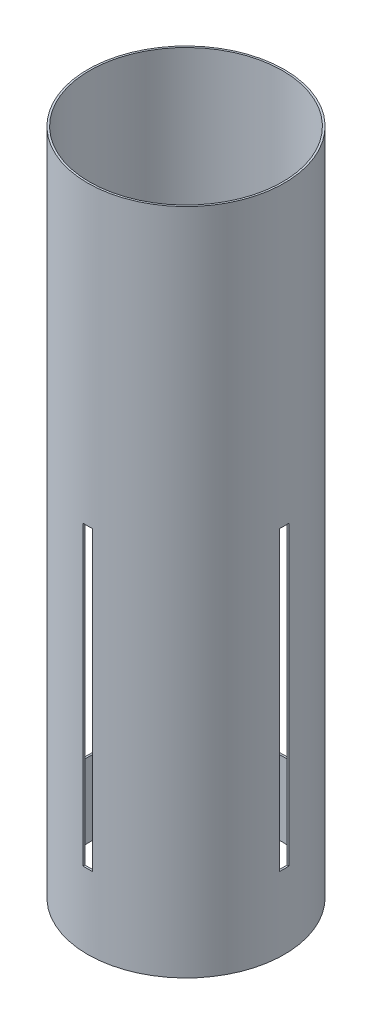
ISO-10303-21;
HEADER;
FILE_DESCRIPTION(('STEP AP214'),'2;1');
FILE_NAME('part.step','',(''),(''),'','','');
FILE_SCHEMA(('AUTOMOTIVE_DESIGN { 1 0 10303 214 1 1 1 1 }'));
ENDSEC;
DATA;
#1=APPLICATION_CONTEXT('core data for automotive mechanical design processes');
#2=APPLICATION_PROTOCOL_DEFINITION('international standard','automotive_design',2000,#1);
#3=PRODUCT_CONTEXT('',#1,'mechanical');
#4=PRODUCT('Part','Part','',(#3));
#5=PRODUCT_RELATED_PRODUCT_CATEGORY('part','',(#4));
#6=PRODUCT_DEFINITION_FORMATION('','',#4);
#7=PRODUCT_DEFINITION_CONTEXT('part definition',#1,'design');
#8=PRODUCT_DEFINITION('design','',#6,#7);
#9=PRODUCT_DEFINITION_SHAPE('','',#8);
#10=(LENGTH_UNIT() NAMED_UNIT(*) SI_UNIT(.MILLI.,.METRE.));
#11=(NAMED_UNIT(*) PLANE_ANGLE_UNIT() SI_UNIT($,.RADIAN.));
#12=(NAMED_UNIT(*) SI_UNIT($,.STERADIAN.) SOLID_ANGLE_UNIT());
#13=UNCERTAINTY_MEASURE_WITH_UNIT(LENGTH_MEASURE(1.E-05),#10,'distance_accuracy_value','');
#14=(GEOMETRIC_REPRESENTATION_CONTEXT(3) GLOBAL_UNCERTAINTY_ASSIGNED_CONTEXT((#13)) GLOBAL_UNIT_ASSIGNED_CONTEXT((#10,
#11,#12)) REPRESENTATION_CONTEXT('',''));
#15=CARTESIAN_POINT('',(0.,0.,0.));
#16=DIRECTION('',(0.,0.,1.));
#17=DIRECTION('',(1.,0.,0.));
#18=AXIS2_PLACEMENT_3D('',#15,#16,#17);
#19=CARTESIAN_POINT('',(0.,457.2,0.));
#20=DIRECTION('',(0.,-1.,0.));
#21=DIRECTION('',(0.,0.,-1.));
#22=AXIS2_PLACEMENT_3D('',#19,#20,#21);
#23=CYLINDRICAL_SURFACE('',#22,67.31);
#24=DIRECTION('',(0.,-1.,0.));
#25=VECTOR('',#24,1.);
#26=CARTESIAN_POINT('',(3.175,457.2,-67.2350762251371));
#27=LINE('',#26,#25);
#28=CARTESIAN_POINT('',(3.175,50.8,-67.2350762251371));
#29=VERTEX_POINT('',#28);
#30=CARTESIAN_POINT('',(3.175,254.,-67.2350762251371));
#31=VERTEX_POINT('',#30);
#32=EDGE_CURVE('E204',#29,#31,#27,.F.);
#33=ORIENTED_EDGE('',*,*,#32,.T.);
#34=CARTESIAN_POINT('',(0.,254.,0.));
#35=DIRECTION('',(0.,1.,0.));
#36=DIRECTION('',(0.,0.,1.));
#37=AXIS2_PLACEMENT_3D('',#34,#35,#36);
#38=CIRCLE('',#37,67.31);
#39=CARTESIAN_POINT('',(-3.175,254.,-67.2350762251371));
#40=VERTEX_POINT('',#39);
#41=EDGE_CURVE('E213',#31,#40,#38,.T.);
#42=ORIENTED_EDGE('',*,*,#41,.T.);
#43=DIRECTION('',(0.,-1.,0.));
#44=VECTOR('',#43,1.);
#45=CARTESIAN_POINT('',(-3.175,457.2,-67.2350762251371));
#46=LINE('',#45,#44);
#47=CARTESIAN_POINT('',(-3.175,50.8,-67.2350762251371));
#48=VERTEX_POINT('',#47);
#49=EDGE_CURVE('E214',#48,#40,#46,.F.);
#50=ORIENTED_EDGE('',*,*,#49,.F.);
#51=CARTESIAN_POINT('',(0.,50.8,0.));
#52=DIRECTION('',(0.,1.,0.));
#53=DIRECTION('',(0.,0.,1.));
#54=AXIS2_PLACEMENT_3D('',#51,#52,#53);
#55=CIRCLE('',#54,67.31);
#56=EDGE_CURVE('E202',#29,#48,#55,.T.);
#57=ORIENTED_EDGE('',*,*,#56,.F.);
#58=EDGE_LOOP('',(#33,#42,#50,#57));
#59=FACE_BOUND('',#58,.T.);
#60=CARTESIAN_POINT('',(0.,0.,0.));
#61=DIRECTION('',(0.,1.,0.));
#62=DIRECTION('',(0.,0.,1.));
#63=AXIS2_PLACEMENT_3D('',#60,#61,#62);
#64=CIRCLE('',#63,67.31);
#65=CARTESIAN_POINT('',(0.,0.,67.31));
#66=VERTEX_POINT('',#65);
#67=EDGE_CURVE('E224',#66,#66,#64,.T.);
#68=ORIENTED_EDGE('',*,*,#67,.T.);
#69=EDGE_LOOP('',(#68));
#70=FACE_BOUND('',#69,.T.);
#71=CARTESIAN_POINT('',(0.,457.2,0.));
#72=DIRECTION('',(0.,1.,0.));
#73=DIRECTION('',(0.,0.,1.));
#74=AXIS2_PLACEMENT_3D('',#71,#72,#73);
#75=CIRCLE('',#74,67.31);
#76=CARTESIAN_POINT('',(0.,457.2,67.31));
#77=VERTEX_POINT('',#76);
#78=EDGE_CURVE('E227',#77,#77,#75,.T.);
#79=ORIENTED_EDGE('',*,*,#78,.F.);
#80=EDGE_LOOP('',(#79));
#81=FACE_BOUND('',#80,.T.);
#82=CARTESIAN_POINT('',(-3.175,254.,67.2350762251371));
#83=VERTEX_POINT('',#82);
#84=CARTESIAN_POINT('',(3.175,254.,67.2350762251371));
#85=VERTEX_POINT('',#84);
#86=EDGE_CURVE('E211',#83,#85,#38,.T.);
#87=ORIENTED_EDGE('',*,*,#86,.T.);
#88=DIRECTION('',(0.,-1.,0.));
#89=VECTOR('',#88,1.);
#90=CARTESIAN_POINT('',(3.175,457.2,67.2350762251371));
#91=LINE('',#90,#89);
#92=CARTESIAN_POINT('',(3.175,50.8,67.2350762251371));
#93=VERTEX_POINT('',#92);
#94=EDGE_CURVE('E208',#85,#93,#91,.T.);
#95=ORIENTED_EDGE('',*,*,#94,.T.);
#96=CARTESIAN_POINT('',(-3.175,50.8,67.2350762251371));
#97=VERTEX_POINT('',#96);
#98=EDGE_CURVE('E205',#97,#93,#55,.T.);
#99=ORIENTED_EDGE('',*,*,#98,.F.);
#100=DIRECTION('',(0.,-1.,0.));
#101=VECTOR('',#100,1.);
#102=CARTESIAN_POINT('',(-3.175,457.2,67.2350762251371));
#103=LINE('',#102,#101);
#104=EDGE_CURVE('E217',#83,#97,#103,.T.);
#105=ORIENTED_EDGE('',*,*,#104,.F.);
#106=EDGE_LOOP('',(#87,#95,#99,#105));
#107=FACE_BOUND('',#106,.T.);
#108=DIRECTION('',(0.,-1.,0.));
#109=VECTOR('',#108,1.);
#110=CARTESIAN_POINT('',(67.2350762251371,457.2,3.17499999999976));
#111=LINE('',#110,#109);
#112=CARTESIAN_POINT('',(67.2350762251371,254.,3.17499999999977));
#113=VERTEX_POINT('',#112);
#114=CARTESIAN_POINT('',(67.2350762251371,50.8,3.17499999999977));
#115=VERTEX_POINT('',#114);
#116=EDGE_CURVE('E184',#113,#115,#111,.T.);
#117=ORIENTED_EDGE('',*,*,#116,.F.);
#118=CARTESIAN_POINT('',(0.,254.,0.));
#119=DIRECTION('',(0.,1.,0.));
#120=DIRECTION('',(0.,0.,1.));
#121=AXIS2_PLACEMENT_3D('',#118,#119,#120);
#122=CIRCLE('',#121,67.31);
#123=CARTESIAN_POINT('',(67.2350762251371,254.,-3.17500000000023));
#124=VERTEX_POINT('',#123);
#125=EDGE_CURVE('E158',#113,#124,#122,.T.);
#126=ORIENTED_EDGE('',*,*,#125,.T.);
#127=DIRECTION('',(0.,-1.,0.));
#128=VECTOR('',#127,1.);
#129=CARTESIAN_POINT('',(67.2350762251371,457.2,-3.17500000000023));
#130=LINE('',#129,#128);
#131=CARTESIAN_POINT('',(67.2350762251371,50.8,-3.17500000000023));
#132=VERTEX_POINT('',#131);
#133=EDGE_CURVE('E181',#124,#132,#130,.T.);
#134=ORIENTED_EDGE('',*,*,#133,.T.);
#135=CARTESIAN_POINT('',(0.,50.8,0.));
#136=DIRECTION('',(0.,1.,0.));
#137=DIRECTION('',(0.,0.,1.));
#138=AXIS2_PLACEMENT_3D('',#135,#136,#137);
#139=CIRCLE('',#138,67.31);
#140=EDGE_CURVE('E168',#115,#132,#139,.T.);
#141=ORIENTED_EDGE('',*,*,#140,.F.);
#142=EDGE_LOOP('',(#117,#126,#134,#141));
#143=FACE_BOUND('',#142,.T.);
#144=DIRECTION('',(0.,-1.,0.));
#145=VECTOR('',#144,1.);
#146=CARTESIAN_POINT('',(-67.2350762251371,457.2,-3.17499999999976));
#147=LINE('',#146,#145);
#148=CARTESIAN_POINT('',(-67.2350762251371,50.8,-3.17499999999977));
#149=VERTEX_POINT('',#148);
#150=CARTESIAN_POINT('',(-67.2350762251371,254.,-3.17499999999977));
#151=VERTEX_POINT('',#150);
#152=EDGE_CURVE('E148',#149,#151,#147,.F.);
#153=ORIENTED_EDGE('',*,*,#152,.T.);
#154=CARTESIAN_POINT('',(-67.2350762251371,254.,3.17500000000023));
#155=VERTEX_POINT('',#154);
#156=EDGE_CURVE('E178',#151,#155,#122,.T.);
#157=ORIENTED_EDGE('',*,*,#156,.T.);
#158=DIRECTION('',(0.,-1.,0.));
#159=VECTOR('',#158,1.);
#160=CARTESIAN_POINT('',(-67.2350762251371,457.2,3.17500000000023));
#161=LINE('',#160,#159);
#162=CARTESIAN_POINT('',(-67.2350762251371,50.8,3.17500000000023));
#163=VERTEX_POINT('',#162);
#164=EDGE_CURVE('E157',#163,#155,#161,.F.);
#165=ORIENTED_EDGE('',*,*,#164,.F.);
#166=EDGE_CURVE('E161',#149,#163,#139,.T.);
#167=ORIENTED_EDGE('',*,*,#166,.F.);
#168=EDGE_LOOP('',(#153,#157,#165,#167));
#169=FACE_BOUND('',#168,.T.);
#170=ADVANCED_FACE('F35',(#59,#70,#81,#107,#143,#169),#23,.T.);
#171=CARTESIAN_POINT('',(0.,457.2,0.));
#172=DIRECTION('',(0.,-1.,0.));
#173=DIRECTION('',(0.,0.,-1.));
#174=AXIS2_PLACEMENT_3D('',#171,#172,#173);
#175=CYLINDRICAL_SURFACE('',#174,66.04);
#176=CARTESIAN_POINT('',(0.,254.,0.));
#177=DIRECTION('',(0.,1.,0.));
#178=DIRECTION('',(0.,0.,1.));
#179=AXIS2_PLACEMENT_3D('',#176,#177,#178);
#180=CIRCLE('',#179,66.04);
#181=CARTESIAN_POINT('',(65.9636337310188,254.,3.17499999999977));
#182=VERTEX_POINT('',#181);
#183=CARTESIAN_POINT('',(65.9636337310188,254.,-3.17500000000023));
#184=VERTEX_POINT('',#183);
#185=EDGE_CURVE('E176',#182,#184,#180,.T.);
#186=ORIENTED_EDGE('',*,*,#185,.F.);
#187=DIRECTION('',(0.,-1.,0.));
#188=VECTOR('',#187,1.);
#189=CARTESIAN_POINT('',(65.9636337310188,457.2,3.17499999999977));
#190=LINE('',#189,#188);
#191=CARTESIAN_POINT('',(65.9636337310188,50.8,3.17499999999977));
#192=VERTEX_POINT('',#191);
#193=EDGE_CURVE('E11',#182,#192,#190,.T.);
#194=ORIENTED_EDGE('',*,*,#193,.T.);
#195=CARTESIAN_POINT('',(0.,50.8,0.));
#196=DIRECTION('',(0.,1.,0.));
#197=DIRECTION('',(0.,0.,1.));
#198=AXIS2_PLACEMENT_3D('',#195,#196,#197);
#199=CIRCLE('',#198,66.04);
#200=CARTESIAN_POINT('',(65.9636337310188,50.8,-3.17500000000023));
#201=VERTEX_POINT('',#200);
#202=EDGE_CURVE('E169',#192,#201,#199,.T.);
#203=ORIENTED_EDGE('',*,*,#202,.T.);
#204=DIRECTION('',(0.,-1.,0.));
#205=VECTOR('',#204,1.);
#206=CARTESIAN_POINT('',(65.9636337310188,457.2,-3.17500000000023));
#207=LINE('',#206,#205);
#208=EDGE_CURVE('E42',#184,#201,#207,.T.);
#209=ORIENTED_EDGE('',*,*,#208,.F.);
#210=EDGE_LOOP('',(#186,#194,#203,#209));
#211=FACE_BOUND('',#210,.T.);
#212=CARTESIAN_POINT('',(0.,457.2,0.));
#213=DIRECTION('',(0.,1.,0.));
#214=DIRECTION('',(0.,0.,1.));
#215=AXIS2_PLACEMENT_3D('',#212,#213,#214);
#216=CIRCLE('',#215,66.04);
#217=CARTESIAN_POINT('',(0.,457.2,66.04));
#218=VERTEX_POINT('',#217);
#219=EDGE_CURVE('E221',#218,#218,#216,.T.);
#220=ORIENTED_EDGE('',*,*,#219,.T.);
#221=EDGE_LOOP('',(#220));
#222=FACE_BOUND('',#221,.T.);
#223=CARTESIAN_POINT('',(0.,0.,0.));
#224=DIRECTION('',(0.,1.,0.));
#225=DIRECTION('',(0.,0.,1.));
#226=AXIS2_PLACEMENT_3D('',#223,#224,#225);
#227=CIRCLE('',#226,66.04);
#228=CARTESIAN_POINT('',(0.,0.,66.04));
#229=VERTEX_POINT('',#228);
#230=EDGE_CURVE('E220',#229,#229,#227,.T.);
#231=ORIENTED_EDGE('',*,*,#230,.F.);
#232=EDGE_LOOP('',(#231));
#233=FACE_BOUND('',#232,.T.);
#234=CARTESIAN_POINT('',(0.,254.,0.));
#235=DIRECTION('',(0.,1.,0.));
#236=DIRECTION('',(0.,0.,1.));
#237=AXIS2_PLACEMENT_3D('',#234,#235,#236);
#238=CIRCLE('',#237,66.04);
#239=CARTESIAN_POINT('',(-3.175,254.,65.9636337310188));
#240=VERTEX_POINT('',#239);
#241=CARTESIAN_POINT('',(3.175,254.,65.9636337310188));
#242=VERTEX_POINT('',#241);
#243=EDGE_CURVE('E239',#240,#242,#238,.T.);
#244=ORIENTED_EDGE('',*,*,#243,.F.);
#245=DIRECTION('',(0.,-1.,0.));
#246=VECTOR('',#245,1.);
#247=CARTESIAN_POINT('',(-3.175,457.2,65.9636337310188));
#248=LINE('',#247,#246);
#249=CARTESIAN_POINT('',(-3.175,50.8,65.9636337310188));
#250=VERTEX_POINT('',#249);
#251=EDGE_CURVE('E241',#240,#250,#248,.T.);
#252=ORIENTED_EDGE('',*,*,#251,.T.);
#253=CARTESIAN_POINT('',(0.,50.8,0.));
#254=DIRECTION('',(0.,1.,0.));
#255=DIRECTION('',(0.,0.,1.));
#256=AXIS2_PLACEMENT_3D('',#253,#254,#255);
#257=CIRCLE('',#256,66.04);
#258=CARTESIAN_POINT('',(3.175,50.8,65.9636337310188));
#259=VERTEX_POINT('',#258);
#260=EDGE_CURVE('E230',#250,#259,#257,.T.);
#261=ORIENTED_EDGE('',*,*,#260,.T.);
#262=DIRECTION('',(0.,-1.,0.));
#263=VECTOR('',#262,1.);
#264=CARTESIAN_POINT('',(3.175,457.2,65.9636337310188));
#265=LINE('',#264,#263);
#266=EDGE_CURVE('E235',#242,#259,#265,.T.);
#267=ORIENTED_EDGE('',*,*,#266,.F.);
#268=EDGE_LOOP('',(#244,#252,#261,#267));
#269=FACE_BOUND('',#268,.T.);
#270=CARTESIAN_POINT('',(3.175,50.8,-65.9636337310188));
#271=VERTEX_POINT('',#270);
#272=CARTESIAN_POINT('',(-3.175,50.8,-65.9636337310188));
#273=VERTEX_POINT('',#272);
#274=EDGE_CURVE('E236',#271,#273,#257,.T.);
#275=ORIENTED_EDGE('',*,*,#274,.T.);
#276=DIRECTION('',(0.,-1.,0.));
#277=VECTOR('',#276,1.);
#278=CARTESIAN_POINT('',(-3.175,457.2,-65.9636337310188));
#279=LINE('',#278,#277);
#280=CARTESIAN_POINT('',(-3.175,254.,-65.9636337310188));
#281=VERTEX_POINT('',#280);
#282=EDGE_CURVE('E247',#273,#281,#279,.F.);
#283=ORIENTED_EDGE('',*,*,#282,.T.);
#284=CARTESIAN_POINT('',(3.175,254.,-65.9636337310188));
#285=VERTEX_POINT('',#284);
#286=EDGE_CURVE('E242',#285,#281,#238,.T.);
#287=ORIENTED_EDGE('',*,*,#286,.F.);
#288=DIRECTION('',(0.,-1.,0.));
#289=VECTOR('',#288,1.);
#290=CARTESIAN_POINT('',(3.175,457.2,-65.9636337310188));
#291=LINE('',#290,#289);
#292=EDGE_CURVE('E245',#271,#285,#291,.F.);
#293=ORIENTED_EDGE('',*,*,#292,.F.);
#294=EDGE_LOOP('',(#275,#283,#287,#293));
#295=FACE_BOUND('',#294,.T.);
#296=CARTESIAN_POINT('',(-65.9636337310188,50.8,-3.17499999999977));
#297=VERTEX_POINT('',#296);
#298=CARTESIAN_POINT('',(-65.9636337310188,50.8,3.17500000000023));
#299=VERTEX_POINT('',#298);
#300=EDGE_CURVE('E163',#297,#299,#199,.T.);
#301=ORIENTED_EDGE('',*,*,#300,.T.);
#302=DIRECTION('',(0.,-1.,0.));
#303=VECTOR('',#302,1.);
#304=CARTESIAN_POINT('',(-65.9636337310188,457.2,3.17500000000023));
#305=LINE('',#304,#303);
#306=CARTESIAN_POINT('',(-65.9636337310188,254.,3.17500000000023));
#307=VERTEX_POINT('',#306);
#308=EDGE_CURVE('E252',#299,#307,#305,.F.);
#309=ORIENTED_EDGE('',*,*,#308,.T.);
#310=CARTESIAN_POINT('',(-65.9636337310188,254.,-3.17499999999977));
#311=VERTEX_POINT('',#310);
#312=EDGE_CURVE('E171',#311,#307,#180,.T.);
#313=ORIENTED_EDGE('',*,*,#312,.F.);
#314=DIRECTION('',(0.,-1.,0.));
#315=VECTOR('',#314,1.);
#316=CARTESIAN_POINT('',(-65.9636337310188,457.2,-3.17499999999977));
#317=LINE('',#316,#315);
#318=EDGE_CURVE('E250',#297,#311,#317,.F.);
#319=ORIENTED_EDGE('',*,*,#318,.F.);
#320=EDGE_LOOP('',(#301,#309,#313,#319));
#321=FACE_BOUND('',#320,.T.);
#322=ADVANCED_FACE('F262',(#211,#222,#233,#269,#295,#321),#175,.F.);
#323=CARTESIAN_POINT('',(0.,457.2,0.));
#324=DIRECTION('',(0.,1.,0.));
#325=DIRECTION('',(0.,0.,1.));
#326=AXIS2_PLACEMENT_3D('',#323,#324,#325);
#327=PLANE('',#326);
#328=ORIENTED_EDGE('',*,*,#78,.T.);
#329=EDGE_LOOP('',(#328));
#330=FACE_BOUND('',#329,.T.);
#331=ORIENTED_EDGE('',*,*,#219,.F.);
#332=EDGE_LOOP('',(#331));
#333=FACE_BOUND('',#332,.T.);
#334=ADVANCED_FACE('F302',(#330,#333),#327,.T.);
#335=CARTESIAN_POINT('',(0.,0.,0.));
#336=DIRECTION('',(0.,1.,0.));
#337=DIRECTION('',(0.,0.,1.));
#338=AXIS2_PLACEMENT_3D('',#335,#336,#337);
#339=PLANE('',#338);
#340=ORIENTED_EDGE('',*,*,#67,.F.);
#341=EDGE_LOOP('',(#340));
#342=FACE_BOUND('',#341,.T.);
#343=ORIENTED_EDGE('',*,*,#230,.T.);
#344=EDGE_LOOP('',(#343));
#345=FACE_BOUND('',#344,.T.);
#346=ADVANCED_FACE('F343',(#342,#345),#339,.F.);
#347=CARTESIAN_POINT('',(0.,50.8,-67.31));
#348=DIRECTION('',(0.,1.,0.));
#349=DIRECTION('',(0.,0.,1.));
#350=AXIS2_PLACEMENT_3D('',#347,#348,#349);
#351=PLANE('',#350);
#352=ORIENTED_EDGE('',*,*,#98,.T.);
#353=DIRECTION('',(0.,0.,1.));
#354=VECTOR('',#353,1.);
#355=CARTESIAN_POINT('',(3.175,50.8,-67.31));
#356=LINE('',#355,#354);
#357=EDGE_CURVE('E196',#259,#93,#356,.T.);
#358=ORIENTED_EDGE('',*,*,#357,.F.);
#359=ORIENTED_EDGE('',*,*,#260,.F.);
#360=DIRECTION('',(0.,0.,1.));
#361=VECTOR('',#360,1.);
#362=CARTESIAN_POINT('',(-3.175,50.8,-67.31));
#363=LINE('',#362,#361);
#364=EDGE_CURVE('E186',#250,#97,#363,.T.);
#365=ORIENTED_EDGE('',*,*,#364,.T.);
#366=EDGE_LOOP('',(#352,#358,#359,#365));
#367=FACE_BOUND('',#366,.T.);
#368=ADVANCED_FACE('F333',(#367),#351,.T.);
#369=CARTESIAN_POINT('',(3.175,0.,-67.31));
#370=DIRECTION('',(1.,0.,0.));
#371=DIRECTION('',(0.,1.,0.));
#372=AXIS2_PLACEMENT_3D('',#369,#370,#371);
#373=PLANE('',#372);
#374=DIRECTION('',(0.,0.,1.));
#375=VECTOR('',#374,1.);
#376=CARTESIAN_POINT('',(3.175,254.,-67.31));
#377=LINE('',#376,#375);
#378=EDGE_CURVE('E192',#242,#85,#377,.T.);
#379=ORIENTED_EDGE('',*,*,#378,.F.);
#380=ORIENTED_EDGE('',*,*,#266,.T.);
#381=ORIENTED_EDGE('',*,*,#357,.T.);
#382=ORIENTED_EDGE('',*,*,#94,.F.);
#383=EDGE_LOOP('',(#379,#380,#381,#382));
#384=FACE_BOUND('',#383,.T.);
#385=ADVANCED_FACE('F340',(#384),#373,.F.);
#386=CARTESIAN_POINT('',(0.,254.,-67.31));
#387=DIRECTION('',(0.,1.,0.));
#388=DIRECTION('',(0.,0.,1.));
#389=AXIS2_PLACEMENT_3D('',#386,#387,#388);
#390=PLANE('',#389);
#391=ORIENTED_EDGE('',*,*,#86,.F.);
#392=DIRECTION('',(0.,0.,1.));
#393=VECTOR('',#392,1.);
#394=CARTESIAN_POINT('',(-3.175,254.,-67.31));
#395=LINE('',#394,#393);
#396=EDGE_CURVE('E187',#240,#83,#395,.T.);
#397=ORIENTED_EDGE('',*,*,#396,.F.);
#398=ORIENTED_EDGE('',*,*,#243,.T.);
#399=ORIENTED_EDGE('',*,*,#378,.T.);
#400=EDGE_LOOP('',(#391,#397,#398,#399));
#401=FACE_BOUND('',#400,.T.);
#402=ADVANCED_FACE('F349',(#401),#390,.F.);
#403=CARTESIAN_POINT('',(-3.175,0.,-67.31));
#404=DIRECTION('',(1.,0.,0.));
#405=DIRECTION('',(0.,1.,0.));
#406=AXIS2_PLACEMENT_3D('',#403,#404,#405);
#407=PLANE('',#406);
#408=ORIENTED_EDGE('',*,*,#104,.T.);
#409=ORIENTED_EDGE('',*,*,#364,.F.);
#410=ORIENTED_EDGE('',*,*,#251,.F.);
#411=ORIENTED_EDGE('',*,*,#396,.T.);
#412=EDGE_LOOP('',(#408,#409,#410,#411));
#413=FACE_BOUND('',#412,.T.);
#414=ADVANCED_FACE('F360',(#413),#407,.T.);
#415=ORIENTED_EDGE('',*,*,#49,.T.);
#416=EDGE_CURVE('E190',#40,#281,#395,.T.);
#417=ORIENTED_EDGE('',*,*,#416,.T.);
#418=ORIENTED_EDGE('',*,*,#282,.F.);
#419=EDGE_CURVE('E199',#48,#273,#363,.T.);
#420=ORIENTED_EDGE('',*,*,#419,.F.);
#421=EDGE_LOOP('',(#415,#417,#418,#420));
#422=FACE_BOUND('',#421,.T.);
#423=ADVANCED_FACE('F367',(#422),#407,.T.);
#424=EDGE_CURVE('E191',#31,#285,#377,.T.);
#425=ORIENTED_EDGE('',*,*,#424,.T.);
#426=ORIENTED_EDGE('',*,*,#286,.T.);
#427=ORIENTED_EDGE('',*,*,#416,.F.);
#428=ORIENTED_EDGE('',*,*,#41,.F.);
#429=EDGE_LOOP('',(#425,#426,#427,#428));
#430=FACE_BOUND('',#429,.T.);
#431=ADVANCED_FACE('F337',(#430),#390,.F.);
#432=EDGE_CURVE('E195',#29,#271,#356,.T.);
#433=ORIENTED_EDGE('',*,*,#432,.T.);
#434=ORIENTED_EDGE('',*,*,#292,.T.);
#435=ORIENTED_EDGE('',*,*,#424,.F.);
#436=ORIENTED_EDGE('',*,*,#32,.F.);
#437=EDGE_LOOP('',(#433,#434,#435,#436));
#438=FACE_BOUND('',#437,.T.);
#439=ADVANCED_FACE('F330',(#438),#373,.F.);
#440=ORIENTED_EDGE('',*,*,#56,.T.);
#441=ORIENTED_EDGE('',*,*,#419,.T.);
#442=ORIENTED_EDGE('',*,*,#274,.F.);
#443=ORIENTED_EDGE('',*,*,#432,.F.);
#444=EDGE_LOOP('',(#440,#441,#442,#443));
#445=FACE_BOUND('',#444,.T.);
#446=ADVANCED_FACE('F326',(#445),#351,.T.);
#447=CARTESIAN_POINT('',(-67.3100000000002,50.8,2.35011608917532E-13));
#448=DIRECTION('',(0.,1.,0.));
#449=DIRECTION('',(0.,0.,1.));
#450=AXIS2_PLACEMENT_3D('',#447,#448,#449);
#451=PLANE('',#450);
#452=ORIENTED_EDGE('',*,*,#166,.T.);
#453=DIRECTION('',(1.,0.,0.));
#454=VECTOR('',#453,1.);
#455=CARTESIAN_POINT('',(-67.3100000000002,50.8,3.17500000000023));
#456=LINE('',#455,#454);
#457=EDGE_CURVE('E57',#163,#299,#456,.T.);
#458=ORIENTED_EDGE('',*,*,#457,.T.);
#459=ORIENTED_EDGE('',*,*,#300,.F.);
#460=DIRECTION('',(1.,0.,0.));
#461=VECTOR('',#460,1.);
#462=CARTESIAN_POINT('',(-67.3100000000002,50.8,-3.17499999999976));
#463=LINE('',#462,#461);
#464=EDGE_CURVE('E151',#149,#297,#463,.T.);
#465=ORIENTED_EDGE('',*,*,#464,.F.);
#466=EDGE_LOOP('',(#452,#458,#459,#465));
#467=FACE_BOUND('',#466,.T.);
#468=ADVANCED_FACE('F160',(#467),#451,.T.);
#469=CARTESIAN_POINT('',(-67.3100000000002,0.,-3.17499999999977));
#470=DIRECTION('',(0.,0.,-1.));
#471=DIRECTION('',(-1.,0.,0.));
#472=AXIS2_PLACEMENT_3D('',#469,#470,#471);
#473=PLANE('',#472);
#474=ORIENTED_EDGE('',*,*,#464,.T.);
#475=ORIENTED_EDGE('',*,*,#318,.T.);
#476=DIRECTION('',(1.,0.,0.));
#477=VECTOR('',#476,1.);
#478=CARTESIAN_POINT('',(-67.3100000000002,254.,-3.17499999999976));
#479=LINE('',#478,#477);
#480=EDGE_CURVE('E154',#151,#311,#479,.T.);
#481=ORIENTED_EDGE('',*,*,#480,.F.);
#482=ORIENTED_EDGE('',*,*,#152,.F.);
#483=EDGE_LOOP('',(#474,#475,#481,#482));
#484=FACE_BOUND('',#483,.T.);
#485=ADVANCED_FACE('F150',(#484),#473,.F.);
#486=CARTESIAN_POINT('',(-67.3100000000002,254.,2.35011608917532E-13));
#487=DIRECTION('',(0.,1.,0.));
#488=DIRECTION('',(0.,0.,1.));
#489=AXIS2_PLACEMENT_3D('',#486,#487,#488);
#490=PLANE('',#489);
#491=ORIENTED_EDGE('',*,*,#480,.T.);
#492=ORIENTED_EDGE('',*,*,#312,.T.);
#493=DIRECTION('',(1.,0.,0.));
#494=VECTOR('',#493,1.);
#495=CARTESIAN_POINT('',(-67.3100000000002,254.,3.17500000000023));
#496=LINE('',#495,#494);
#497=EDGE_CURVE('E277',#155,#307,#496,.T.);
#498=ORIENTED_EDGE('',*,*,#497,.F.);
#499=ORIENTED_EDGE('',*,*,#156,.F.);
#500=EDGE_LOOP('',(#491,#492,#498,#499));
#501=FACE_BOUND('',#500,.T.);
#502=ADVANCED_FACE('F284',(#501),#490,.F.);
#503=CARTESIAN_POINT('',(-67.3100000000002,0.,3.17500000000024));
#504=DIRECTION('',(0.,0.,-1.));
#505=DIRECTION('',(-1.,0.,0.));
#506=AXIS2_PLACEMENT_3D('',#503,#504,#505);
#507=PLANE('',#506);
#508=ORIENTED_EDGE('',*,*,#164,.T.);
#509=ORIENTED_EDGE('',*,*,#497,.T.);
#510=ORIENTED_EDGE('',*,*,#308,.F.);
#511=ORIENTED_EDGE('',*,*,#457,.F.);
#512=EDGE_LOOP('',(#508,#509,#510,#511));
#513=FACE_BOUND('',#512,.T.);
#514=ADVANCED_FACE('F285',(#513),#507,.T.);
#515=ORIENTED_EDGE('',*,*,#116,.T.);
#516=EDGE_CURVE('E267',#192,#115,#456,.T.);
#517=ORIENTED_EDGE('',*,*,#516,.F.);
#518=ORIENTED_EDGE('',*,*,#193,.F.);
#519=EDGE_CURVE('E276',#182,#113,#496,.T.);
#520=ORIENTED_EDGE('',*,*,#519,.T.);
#521=EDGE_LOOP('',(#515,#517,#518,#520));
#522=FACE_BOUND('',#521,.T.);
#523=ADVANCED_FACE('F270',(#522),#507,.T.);
#524=EDGE_CURVE('E164',#184,#124,#479,.T.);
#525=ORIENTED_EDGE('',*,*,#524,.F.);
#526=ORIENTED_EDGE('',*,*,#208,.T.);
#527=EDGE_CURVE('E49',#201,#132,#463,.T.);
#528=ORIENTED_EDGE('',*,*,#527,.T.);
#529=ORIENTED_EDGE('',*,*,#133,.F.);
#530=EDGE_LOOP('',(#525,#526,#528,#529));
#531=FACE_BOUND('',#530,.T.);
#532=ADVANCED_FACE('F257',(#531),#473,.F.);
#533=ORIENTED_EDGE('',*,*,#519,.F.);
#534=ORIENTED_EDGE('',*,*,#185,.T.);
#535=ORIENTED_EDGE('',*,*,#524,.T.);
#536=ORIENTED_EDGE('',*,*,#125,.F.);
#537=EDGE_LOOP('',(#533,#534,#535,#536));
#538=FACE_BOUND('',#537,.T.);
#539=ADVANCED_FACE('F293',(#538),#490,.F.);
#540=ORIENTED_EDGE('',*,*,#140,.T.);
#541=ORIENTED_EDGE('',*,*,#527,.F.);
#542=ORIENTED_EDGE('',*,*,#202,.F.);
#543=ORIENTED_EDGE('',*,*,#516,.T.);
#544=EDGE_LOOP('',(#540,#541,#542,#543));
#545=FACE_BOUND('',#544,.T.);
#546=ADVANCED_FACE('F266',(#545),#451,.T.);
#547=CLOSED_SHELL('',(#170,#322,#334,#346,#368,#385,#402,#414,#423,#431,#439,#446,#468,#485,
#502,#514,#523,#532,#539,#546));
#548=MANIFOLD_SOLID_BREP('B2',#547);
#549=ADVANCED_BREP_SHAPE_REPRESENTATION('',(#18,#548),#14);
#550=SHAPE_DEFINITION_REPRESENTATION(#9,#549);
ENDSEC;
END-ISO-10303-21;
